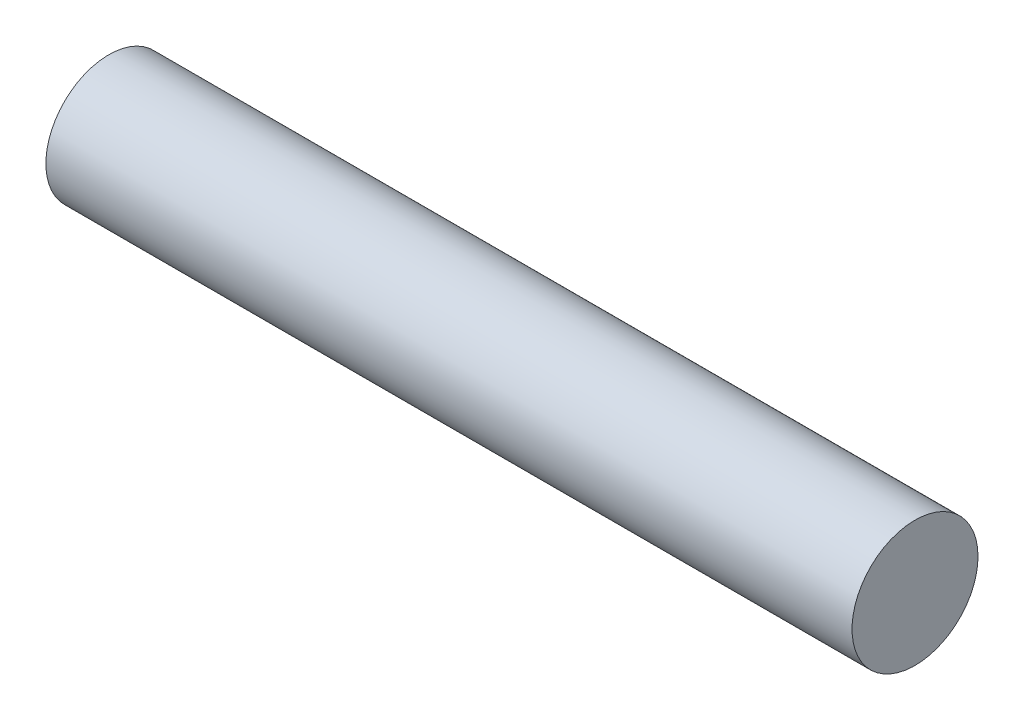
ISO-10303-21;
HEADER;
FILE_DESCRIPTION(('STEP AP214'),'2;1');
FILE_NAME('part.step','',(''),(''),'','','');
FILE_SCHEMA(('AUTOMOTIVE_DESIGN { 1 0 10303 214 1 1 1 1 }'));
ENDSEC;
DATA;
#1=APPLICATION_CONTEXT('core data for automotive mechanical design processes');
#2=APPLICATION_PROTOCOL_DEFINITION('international standard','automotive_design',2000,#1);
#3=PRODUCT_CONTEXT('',#1,'mechanical');
#4=PRODUCT('Part','Part','',(#3));
#5=PRODUCT_RELATED_PRODUCT_CATEGORY('part','',(#4));
#6=PRODUCT_DEFINITION_FORMATION('','',#4);
#7=PRODUCT_DEFINITION_CONTEXT('part definition',#1,'design');
#8=PRODUCT_DEFINITION('design','',#6,#7);
#9=PRODUCT_DEFINITION_SHAPE('','',#8);
#10=(LENGTH_UNIT() NAMED_UNIT(*) SI_UNIT(.MILLI.,.METRE.));
#11=(NAMED_UNIT(*) PLANE_ANGLE_UNIT() SI_UNIT($,.RADIAN.));
#12=(NAMED_UNIT(*) SI_UNIT($,.STERADIAN.) SOLID_ANGLE_UNIT());
#13=UNCERTAINTY_MEASURE_WITH_UNIT(LENGTH_MEASURE(1.E-05),#10,'distance_accuracy_value','');
#14=(GEOMETRIC_REPRESENTATION_CONTEXT(3) GLOBAL_UNCERTAINTY_ASSIGNED_CONTEXT((#13)) GLOBAL_UNIT_ASSIGNED_CONTEXT((#10,
#11,#12)) REPRESENTATION_CONTEXT('',''));
#15=CARTESIAN_POINT('',(0.,0.,0.));
#16=DIRECTION('',(0.,0.,1.));
#17=DIRECTION('',(1.,0.,0.));
#18=AXIS2_PLACEMENT_3D('',#15,#16,#17);
#19=CARTESIAN_POINT('',(20.32,0.,0.));
#20=DIRECTION('',(-1.,0.,0.));
#21=DIRECTION('',(0.,0.,1.));
#22=AXIS2_PLACEMENT_3D('',#19,#20,#21);
#23=CYLINDRICAL_SURFACE('',#22,1.5875);
#24=CARTESIAN_POINT('',(20.32,0.,0.));
#25=DIRECTION('',(1.,0.,0.));
#26=DIRECTION('',(0.,0.,-1.));
#27=AXIS2_PLACEMENT_3D('',#24,#25,#26);
#28=CIRCLE('',#27,1.5875);
#29=CARTESIAN_POINT('',(20.32,0.,-1.5875));
#30=VERTEX_POINT('',#29);
#31=EDGE_CURVE('E10',#30,#30,#28,.T.);
#32=ORIENTED_EDGE('',*,*,#31,.F.);
#33=EDGE_LOOP('',(#32));
#34=FACE_BOUND('',#33,.T.);
#35=CARTESIAN_POINT('',(0.,0.,0.));
#36=DIRECTION('',(1.,0.,0.));
#37=DIRECTION('',(0.,0.,-1.));
#38=AXIS2_PLACEMENT_3D('',#35,#36,#37);
#39=CIRCLE('',#38,1.5875);
#40=CARTESIAN_POINT('',(0.,0.,-1.5875));
#41=VERTEX_POINT('',#40);
#42=EDGE_CURVE('E34',#41,#41,#39,.T.);
#43=ORIENTED_EDGE('',*,*,#42,.T.);
#44=EDGE_LOOP('',(#43));
#45=FACE_BOUND('',#44,.T.);
#46=ADVANCED_FACE('F31',(#34,#45),#23,.T.);
#47=CARTESIAN_POINT('',(20.32,0.,0.));
#48=DIRECTION('',(1.,0.,0.));
#49=DIRECTION('',(0.,0.,-1.));
#50=AXIS2_PLACEMENT_3D('',#47,#48,#49);
#51=PLANE('',#50);
#52=ORIENTED_EDGE('',*,*,#31,.T.);
#53=EDGE_LOOP('',(#52));
#54=FACE_BOUND('',#53,.T.);
#55=ADVANCED_FACE('F46',(#54),#51,.T.);
#56=CARTESIAN_POINT('',(0.,0.,0.));
#57=DIRECTION('',(1.,0.,0.));
#58=DIRECTION('',(0.,0.,-1.));
#59=AXIS2_PLACEMENT_3D('',#56,#57,#58);
#60=PLANE('',#59);
#61=ORIENTED_EDGE('',*,*,#42,.F.);
#62=EDGE_LOOP('',(#61));
#63=FACE_BOUND('',#62,.T.);
#64=ADVANCED_FACE('F44',(#63),#60,.F.);
#65=CLOSED_SHELL('',(#46,#55,#64));
#66=MANIFOLD_SOLID_BREP('B2',#65);
#67=ADVANCED_BREP_SHAPE_REPRESENTATION('',(#18,#66),#14);
#68=SHAPE_DEFINITION_REPRESENTATION(#9,#67);
ENDSEC;
END-ISO-10303-21;
